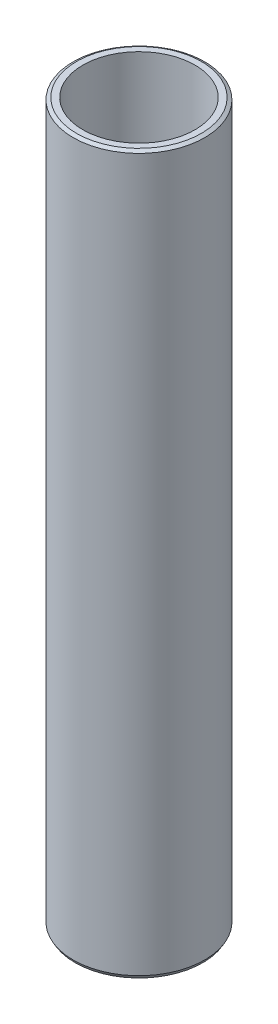
ISO-10303-21;
HEADER;
FILE_DESCRIPTION(('STEP AP214'),'2;1');
FILE_NAME('part.step','',(''),(''),'','','');
FILE_SCHEMA(('AUTOMOTIVE_DESIGN { 1 0 10303 214 1 1 1 1 }'));
ENDSEC;
DATA;
#1=APPLICATION_CONTEXT('core data for automotive mechanical design processes');
#2=APPLICATION_PROTOCOL_DEFINITION('international standard','automotive_design',2000,#1);
#3=PRODUCT_CONTEXT('',#1,'mechanical');
#4=PRODUCT('Part','Part','',(#3));
#5=PRODUCT_RELATED_PRODUCT_CATEGORY('part','',(#4));
#6=PRODUCT_DEFINITION_FORMATION('','',#4);
#7=PRODUCT_DEFINITION_CONTEXT('part definition',#1,'design');
#8=PRODUCT_DEFINITION('design','',#6,#7);
#9=PRODUCT_DEFINITION_SHAPE('','',#8);
#10=(LENGTH_UNIT() NAMED_UNIT(*) SI_UNIT(.MILLI.,.METRE.));
#11=(NAMED_UNIT(*) PLANE_ANGLE_UNIT() SI_UNIT($,.RADIAN.));
#12=(NAMED_UNIT(*) SI_UNIT($,.STERADIAN.) SOLID_ANGLE_UNIT());
#13=UNCERTAINTY_MEASURE_WITH_UNIT(LENGTH_MEASURE(1.E-05),#10,'distance_accuracy_value','');
#14=(GEOMETRIC_REPRESENTATION_CONTEXT(3) GLOBAL_UNCERTAINTY_ASSIGNED_CONTEXT((#13)) GLOBAL_UNIT_ASSIGNED_CONTEXT((#10,
#11,#12)) REPRESENTATION_CONTEXT('',''));
#15=CARTESIAN_POINT('',(0.,0.,0.));
#16=DIRECTION('',(0.,0.,1.));
#17=DIRECTION('',(1.,0.,0.));
#18=AXIS2_PLACEMENT_3D('',#15,#16,#17);
#19=CARTESIAN_POINT('',(0.,600.,0.));
#20=DIRECTION('',(0.,-1.,0.));
#21=DIRECTION('',(0.,0.,-1.));
#22=AXIS2_PLACEMENT_3D('',#19,#20,#21);
#23=CYLINDRICAL_SURFACE('',#22,55.);
#24=CARTESIAN_POINT('',(0.,598.355152559775,0.));
#25=DIRECTION('',(0.,1.,0.));
#26=DIRECTION('',(0.,0.,1.));
#27=AXIS2_PLACEMENT_3D('',#24,#25,#26);
#28=CIRCLE('',#27,55.);
#29=CARTESIAN_POINT('',(0.,598.355152559775,55.));
#30=VERTEX_POINT('',#29);
#31=EDGE_CURVE('E50',#30,#30,#28,.F.);
#32=ORIENTED_EDGE('',*,*,#31,.T.);
#33=EDGE_LOOP('',(#32));
#34=FACE_BOUND('',#33,.T.);
#35=CARTESIAN_POINT('',(0.,2.84895933716967,0.));
#36=DIRECTION('',(0.,1.,0.));
#37=DIRECTION('',(0.,0.,1.));
#38=AXIS2_PLACEMENT_3D('',#35,#36,#37);
#39=CIRCLE('',#38,55.);
#40=CARTESIAN_POINT('',(0.,2.84895933716967,55.));
#41=VERTEX_POINT('',#40);
#42=EDGE_CURVE('E51',#41,#41,#39,.T.);
#43=ORIENTED_EDGE('',*,*,#42,.T.);
#44=EDGE_LOOP('',(#43));
#45=FACE_BOUND('',#44,.T.);
#46=ADVANCED_FACE('F39',(#34,#45),#23,.T.);
#47=CARTESIAN_POINT('',(0.,600.,0.));
#48=DIRECTION('',(0.,1.,0.));
#49=DIRECTION('',(0.,0.,1.));
#50=AXIS2_PLACEMENT_3D('',#47,#48,#49);
#51=PLANE('',#50);
#52=CARTESIAN_POINT('',(0.,600.,0.));
#53=DIRECTION('',(0.,1.,0.));
#54=DIRECTION('',(0.,0.,1.));
#55=AXIS2_PLACEMENT_3D('',#52,#53,#54);
#56=CIRCLE('',#55,52.1510406628306);
#57=CARTESIAN_POINT('',(0.,600.,52.1510406628306));
#58=VERTEX_POINT('',#57);
#59=EDGE_CURVE('E54',#58,#58,#56,.T.);
#60=ORIENTED_EDGE('',*,*,#59,.T.);
#61=EDGE_LOOP('',(#60));
#62=FACE_BOUND('',#61,.T.);
#63=CARTESIAN_POINT('',(0.,600.,0.));
#64=DIRECTION('',(0.,1.,0.));
#65=DIRECTION('',(0.,0.,1.));
#66=AXIS2_PLACEMENT_3D('',#63,#64,#65);
#67=CIRCLE('',#66,46.8890951273649);
#68=CARTESIAN_POINT('',(0.,600.,46.8890951273649));
#69=VERTEX_POINT('',#68);
#70=EDGE_CURVE('E58',#69,#69,#67,.T.);
#71=ORIENTED_EDGE('',*,*,#70,.F.);
#72=EDGE_LOOP('',(#71));
#73=FACE_BOUND('',#72,.T.);
#74=ADVANCED_FACE('F69',(#62,#73),#51,.T.);
#75=CARTESIAN_POINT('',(0.,0.,0.));
#76=DIRECTION('',(0.,1.,0.));
#77=DIRECTION('',(0.,0.,1.));
#78=AXIS2_PLACEMENT_3D('',#75,#76,#77);
#79=PLANE('',#78);
#80=CARTESIAN_POINT('',(0.,0.,0.));
#81=DIRECTION('',(0.,1.,0.));
#82=DIRECTION('',(0.,0.,1.));
#83=AXIS2_PLACEMENT_3D('',#80,#81,#82);
#84=CIRCLE('',#83,53.3551525597747);
#85=CARTESIAN_POINT('',(0.,0.,53.3551525597747));
#86=VERTEX_POINT('',#85);
#87=EDGE_CURVE('E10',#86,#86,#84,.F.);
#88=ORIENTED_EDGE('',*,*,#87,.T.);
#89=EDGE_LOOP('',(#88));
#90=FACE_BOUND('',#89,.T.);
#91=CARTESIAN_POINT('',(0.,0.,0.));
#92=DIRECTION('',(0.,1.,0.));
#93=DIRECTION('',(0.,0.,1.));
#94=AXIS2_PLACEMENT_3D('',#91,#92,#93);
#95=CIRCLE('',#94,46.8890951273649);
#96=CARTESIAN_POINT('',(0.,0.,46.8890951273649));
#97=VERTEX_POINT('',#96);
#98=EDGE_CURVE('E63',#97,#97,#95,.T.);
#99=ORIENTED_EDGE('',*,*,#98,.T.);
#100=EDGE_LOOP('',(#99));
#101=FACE_BOUND('',#100,.T.);
#102=ADVANCED_FACE('F75',(#90,#101),#79,.F.);
#103=CARTESIAN_POINT('',(0.,600.,0.));
#104=DIRECTION('',(0.,-1.,0.));
#105=DIRECTION('',(0.,0.,-1.));
#106=AXIS2_PLACEMENT_3D('',#103,#104,#105);
#107=CYLINDRICAL_SURFACE('',#106,46.8890951273649);
#108=ORIENTED_EDGE('',*,*,#70,.T.);
#109=EDGE_LOOP('',(#108));
#110=FACE_BOUND('',#109,.T.);
#111=ORIENTED_EDGE('',*,*,#98,.F.);
#112=EDGE_LOOP('',(#111));
#113=FACE_BOUND('',#112,.T.);
#114=ADVANCED_FACE('F70',(#110,#113),#107,.F.);
#115=CARTESIAN_POINT('',(0.,600.,0.));
#116=DIRECTION('',(0.,-1.,0.));
#117=DIRECTION('',(0.,0.,-1.));
#118=AXIS2_PLACEMENT_3D('',#115,#116,#117);
#119=CONICAL_SURFACE('',#118,52.1510406628306,1.04719755119659);
#120=ORIENTED_EDGE('',*,*,#31,.F.);
#121=EDGE_LOOP('',(#120));
#122=FACE_BOUND('',#121,.T.);
#123=ORIENTED_EDGE('',*,*,#59,.F.);
#124=EDGE_LOOP('',(#123));
#125=FACE_BOUND('',#124,.T.);
#126=ADVANCED_FACE('F81',(#122,#125),#119,.T.);
#127=CARTESIAN_POINT('',(0.,2.84895933716967,0.));
#128=DIRECTION('',(0.,1.,0.));
#129=DIRECTION('',(0.,0.,1.));
#130=AXIS2_PLACEMENT_3D('',#127,#128,#129);
#131=CONICAL_SURFACE('',#130,55.,0.523598775598313);
#132=ORIENTED_EDGE('',*,*,#87,.F.);
#133=EDGE_LOOP('',(#132));
#134=FACE_BOUND('',#133,.T.);
#135=ORIENTED_EDGE('',*,*,#42,.F.);
#136=EDGE_LOOP('',(#135));
#137=FACE_BOUND('',#136,.T.);
#138=ADVANCED_FACE('F45',(#134,#137),#131,.T.);
#139=CLOSED_SHELL('',(#46,#74,#102,#114,#126,#138));
#140=MANIFOLD_SOLID_BREP('B2',#139);
#141=ADVANCED_BREP_SHAPE_REPRESENTATION('',(#18,#140),#14);
#142=SHAPE_DEFINITION_REPRESENTATION(#9,#141);
ENDSEC;
END-ISO-10303-21;
